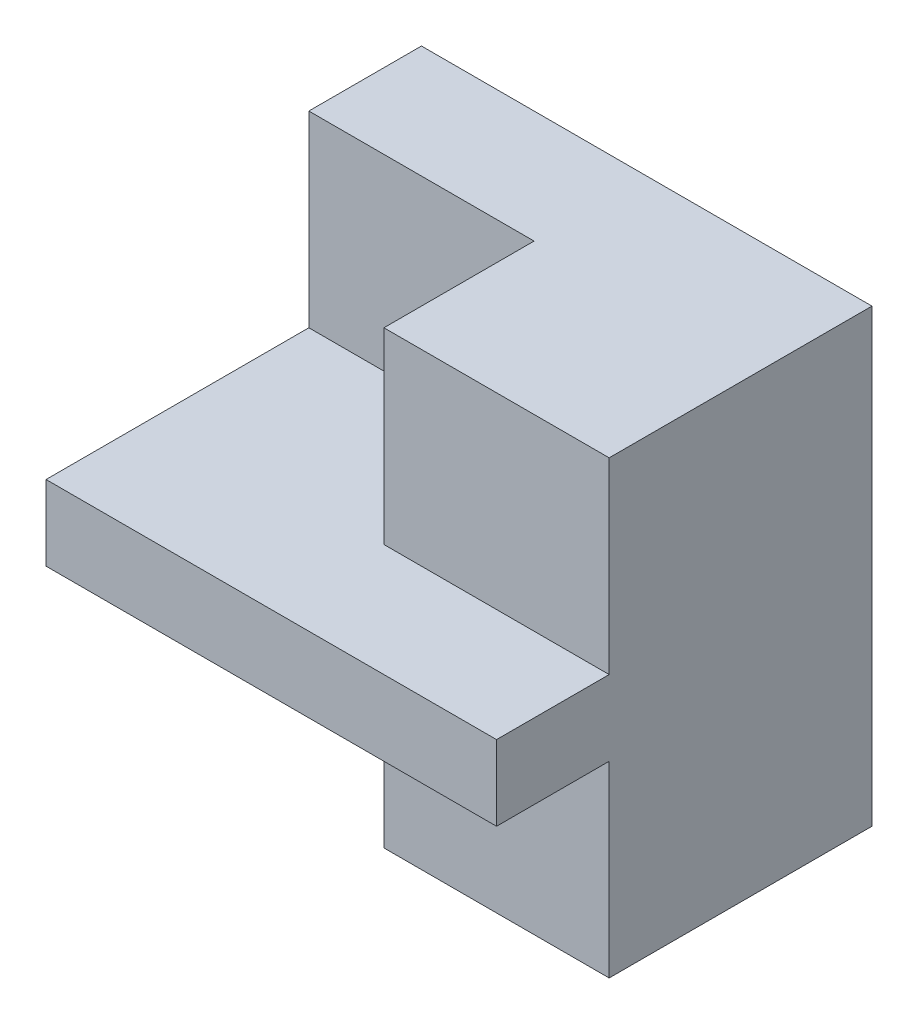
ISO-10303-21;
HEADER;
FILE_DESCRIPTION(('STEP AP214'),'2;1');
FILE_NAME('part.step','',(''),(''),'','','');
FILE_SCHEMA(('AUTOMOTIVE_DESIGN { 1 0 10303 214 1 1 1 1 }'));
ENDSEC;
DATA;
#1=APPLICATION_CONTEXT('core data for automotive mechanical design processes');
#2=APPLICATION_PROTOCOL_DEFINITION('international standard','automotive_design',2000,#1);
#3=PRODUCT_CONTEXT('',#1,'mechanical');
#4=PRODUCT('Part','Part','',(#3));
#5=PRODUCT_RELATED_PRODUCT_CATEGORY('part','',(#4));
#6=PRODUCT_DEFINITION_FORMATION('','',#4);
#7=PRODUCT_DEFINITION_CONTEXT('part definition',#1,'design');
#8=PRODUCT_DEFINITION('design','',#6,#7);
#9=PRODUCT_DEFINITION_SHAPE('','',#8);
#10=(LENGTH_UNIT() NAMED_UNIT(*) SI_UNIT(.MILLI.,.METRE.));
#11=(NAMED_UNIT(*) PLANE_ANGLE_UNIT() SI_UNIT($,.RADIAN.));
#12=(NAMED_UNIT(*) SI_UNIT($,.STERADIAN.) SOLID_ANGLE_UNIT());
#13=UNCERTAINTY_MEASURE_WITH_UNIT(LENGTH_MEASURE(1.E-05),#10,'distance_accuracy_value','');
#14=(GEOMETRIC_REPRESENTATION_CONTEXT(3) GLOBAL_UNCERTAINTY_ASSIGNED_CONTEXT((#13)) GLOBAL_UNIT_ASSIGNED_CONTEXT((#10,
#11,#12)) REPRESENTATION_CONTEXT('',''));
#15=CARTESIAN_POINT('',(0.,0.,0.));
#16=DIRECTION('',(0.,0.,1.));
#17=DIRECTION('',(1.,0.,0.));
#18=AXIS2_PLACEMENT_3D('',#15,#16,#17);
#19=CARTESIAN_POINT('',(-3.,6.,2.5));
#20=DIRECTION('',(0.,0.,-1.));
#21=DIRECTION('',(-1.,0.,0.));
#22=AXIS2_PLACEMENT_3D('',#19,#20,#21);
#23=PLANE('',#22);
#24=DIRECTION('',(0.,-1.,0.));
#25=VECTOR('',#24,1.);
#26=CARTESIAN_POINT('',(-3.,6.,2.5));
#27=LINE('',#26,#25);
#28=CARTESIAN_POINT('',(-3.,3.5,2.5));
#29=VERTEX_POINT('',#28);
#30=CARTESIAN_POINT('',(-3.,2.5,2.5));
#31=VERTEX_POINT('',#30);
#32=EDGE_CURVE('E144',#29,#31,#27,.T.);
#33=ORIENTED_EDGE('',*,*,#32,.T.);
#34=DIRECTION('',(-1.,0.,0.));
#35=VECTOR('',#34,1.);
#36=CARTESIAN_POINT('',(-3.,2.5,2.5));
#37=LINE('',#36,#35);
#38=CARTESIAN_POINT('',(3.,2.5,2.5));
#39=VERTEX_POINT('',#38);
#40=EDGE_CURVE('E128',#39,#31,#37,.T.);
#41=ORIENTED_EDGE('',*,*,#40,.F.);
#42=DIRECTION('',(0.,-1.,0.));
#43=VECTOR('',#42,1.);
#44=CARTESIAN_POINT('',(3.,6.,2.5));
#45=LINE('',#44,#43);
#46=CARTESIAN_POINT('',(3.,3.5,2.5));
#47=VERTEX_POINT('',#46);
#48=EDGE_CURVE('E142',#47,#39,#45,.T.);
#49=ORIENTED_EDGE('',*,*,#48,.F.);
#50=DIRECTION('',(1.,0.,0.));
#51=VECTOR('',#50,1.);
#52=CARTESIAN_POINT('',(-3.,3.5,2.5));
#53=LINE('',#52,#51);
#54=EDGE_CURVE('E186',#29,#47,#53,.T.);
#55=ORIENTED_EDGE('',*,*,#54,.F.);
#56=EDGE_LOOP('',(#33,#41,#49,#55));
#57=FACE_BOUND('',#56,.T.);
#58=ADVANCED_FACE('F33',(#57),#23,.F.);
#59=CARTESIAN_POINT('',(3.,6.,2.5));
#60=DIRECTION('',(-1.,0.,0.));
#61=DIRECTION('',(0.,0.,1.));
#62=AXIS2_PLACEMENT_3D('',#59,#60,#61);
#63=PLANE('',#62);
#64=DIRECTION('',(0.,0.,1.));
#65=VECTOR('',#64,1.);
#66=CARTESIAN_POINT('',(3.,2.5,2.5));
#67=LINE('',#66,#65);
#68=CARTESIAN_POINT('',(3.,2.5,1.));
#69=VERTEX_POINT('',#68);
#70=EDGE_CURVE('E124',#69,#39,#67,.T.);
#71=ORIENTED_EDGE('',*,*,#70,.F.);
#72=DIRECTION('',(0.,-1.,0.));
#73=VECTOR('',#72,1.);
#74=CARTESIAN_POINT('',(3.,2.5,1.));
#75=LINE('',#74,#73);
#76=CARTESIAN_POINT('',(3.,0.,1.));
#77=VERTEX_POINT('',#76);
#78=EDGE_CURVE('E198',#69,#77,#75,.T.);
#79=ORIENTED_EDGE('',*,*,#78,.T.);
#80=DIRECTION('',(0.,0.,-1.));
#81=VECTOR('',#80,1.);
#82=CARTESIAN_POINT('',(3.,0.,2.5));
#83=LINE('',#82,#81);
#84=CARTESIAN_POINT('',(3.,0.,-2.5));
#85=VERTEX_POINT('',#84);
#86=EDGE_CURVE('E179',#77,#85,#83,.T.);
#87=ORIENTED_EDGE('',*,*,#86,.T.);
#88=DIRECTION('',(0.,-1.,0.));
#89=VECTOR('',#88,1.);
#90=CARTESIAN_POINT('',(3.,6.,-2.5));
#91=LINE('',#90,#89);
#92=CARTESIAN_POINT('',(3.,6.,-2.5));
#93=VERTEX_POINT('',#92);
#94=EDGE_CURVE('E11',#93,#85,#91,.T.);
#95=ORIENTED_EDGE('',*,*,#94,.F.);
#96=DIRECTION('',(0.,0.,-1.));
#97=VECTOR('',#96,1.);
#98=CARTESIAN_POINT('',(3.,6.,2.5));
#99=LINE('',#98,#97);
#100=CARTESIAN_POINT('',(3.,6.,1.));
#101=VERTEX_POINT('',#100);
#102=EDGE_CURVE('E177',#101,#93,#99,.T.);
#103=ORIENTED_EDGE('',*,*,#102,.F.);
#104=DIRECTION('',(0.,1.,0.));
#105=VECTOR('',#104,1.);
#106=CARTESIAN_POINT('',(3.,3.5,1.));
#107=LINE('',#106,#105);
#108=CARTESIAN_POINT('',(3.,3.5,1.));
#109=VERTEX_POINT('',#108);
#110=EDGE_CURVE('E56',#109,#101,#107,.T.);
#111=ORIENTED_EDGE('',*,*,#110,.F.);
#112=DIRECTION('',(0.,0.,-1.));
#113=VECTOR('',#112,1.);
#114=CARTESIAN_POINT('',(3.,3.5,2.5));
#115=LINE('',#114,#113);
#116=EDGE_CURVE('E149',#47,#109,#115,.T.);
#117=ORIENTED_EDGE('',*,*,#116,.F.);
#118=ORIENTED_EDGE('',*,*,#48,.T.);
#119=EDGE_LOOP('',(#71,#79,#87,#95,#103,#111,#117,#118));
#120=FACE_BOUND('',#119,.T.);
#121=ADVANCED_FACE('F35',(#120),#63,.F.);
#122=CARTESIAN_POINT('',(-3.,6.,-2.5));
#123=DIRECTION('',(0.,0.,1.));
#124=DIRECTION('',(1.,0.,0.));
#125=AXIS2_PLACEMENT_3D('',#122,#123,#124);
#126=PLANE('',#125);
#127=DIRECTION('',(-1.,0.,0.));
#128=VECTOR('',#127,1.);
#129=CARTESIAN_POINT('',(-3.,0.,-2.5));
#130=LINE('',#129,#128);
#131=CARTESIAN_POINT('',(-3.,0.,-2.5));
#132=VERTEX_POINT('',#131);
#133=EDGE_CURVE('E174',#85,#132,#130,.T.);
#134=ORIENTED_EDGE('',*,*,#133,.T.);
#135=DIRECTION('',(0.,-1.,0.));
#136=VECTOR('',#135,1.);
#137=CARTESIAN_POINT('',(-3.,6.,-2.5));
#138=LINE('',#137,#136);
#139=CARTESIAN_POINT('',(-3.,6.,-2.5));
#140=VERTEX_POINT('',#139);
#141=EDGE_CURVE('E41',#140,#132,#138,.T.);
#142=ORIENTED_EDGE('',*,*,#141,.F.);
#143=DIRECTION('',(-1.,0.,0.));
#144=VECTOR('',#143,1.);
#145=CARTESIAN_POINT('',(-3.,6.,-2.5));
#146=LINE('',#145,#144);
#147=EDGE_CURVE('E154',#93,#140,#146,.T.);
#148=ORIENTED_EDGE('',*,*,#147,.F.);
#149=ORIENTED_EDGE('',*,*,#94,.T.);
#150=EDGE_LOOP('',(#134,#142,#148,#149));
#151=FACE_BOUND('',#150,.T.);
#152=ADVANCED_FACE('F242',(#151),#126,.F.);
#153=CARTESIAN_POINT('',(-3.,6.,2.5));
#154=DIRECTION('',(1.,0.,0.));
#155=DIRECTION('',(0.,0.,-1.));
#156=AXIS2_PLACEMENT_3D('',#153,#154,#155);
#157=PLANE('',#156);
#158=DIRECTION('',(0.,0.,1.));
#159=VECTOR('',#158,1.);
#160=CARTESIAN_POINT('',(-3.,0.,2.5));
#161=LINE('',#160,#159);
#162=CARTESIAN_POINT('',(-3.,0.,-1.));
#163=VERTEX_POINT('',#162);
#164=EDGE_CURVE('E157',#132,#163,#161,.T.);
#165=ORIENTED_EDGE('',*,*,#164,.T.);
#166=DIRECTION('',(0.,-1.,0.));
#167=VECTOR('',#166,1.);
#168=CARTESIAN_POINT('',(-3.,2.5,-1.));
#169=LINE('',#168,#167);
#170=CARTESIAN_POINT('',(-3.,2.5,-1.));
#171=VERTEX_POINT('',#170);
#172=EDGE_CURVE('E48',#171,#163,#169,.T.);
#173=ORIENTED_EDGE('',*,*,#172,.F.);
#174=DIRECTION('',(0.,0.,-1.));
#175=VECTOR('',#174,1.);
#176=CARTESIAN_POINT('',(-3.,2.5,-1.));
#177=LINE('',#176,#175);
#178=EDGE_CURVE('E145',#31,#171,#177,.T.);
#179=ORIENTED_EDGE('',*,*,#178,.F.);
#180=ORIENTED_EDGE('',*,*,#32,.F.);
#181=DIRECTION('',(0.,0.,1.));
#182=VECTOR('',#181,1.);
#183=CARTESIAN_POINT('',(-3.,3.5,-1.));
#184=LINE('',#183,#182);
#185=CARTESIAN_POINT('',(-3.,3.5,-1.));
#186=VERTEX_POINT('',#185);
#187=EDGE_CURVE('E200',#186,#29,#184,.T.);
#188=ORIENTED_EDGE('',*,*,#187,.F.);
#189=DIRECTION('',(0.,1.,0.));
#190=VECTOR('',#189,1.);
#191=CARTESIAN_POINT('',(-3.,3.5,-1.));
#192=LINE('',#191,#190);
#193=CARTESIAN_POINT('',(-3.,6.,-1.));
#194=VERTEX_POINT('',#193);
#195=EDGE_CURVE('E180',#186,#194,#192,.T.);
#196=ORIENTED_EDGE('',*,*,#195,.T.);
#197=DIRECTION('',(0.,0.,1.));
#198=VECTOR('',#197,1.);
#199=CARTESIAN_POINT('',(-3.,6.,2.5));
#200=LINE('',#199,#198);
#201=EDGE_CURVE('E150',#140,#194,#200,.T.);
#202=ORIENTED_EDGE('',*,*,#201,.F.);
#203=ORIENTED_EDGE('',*,*,#141,.T.);
#204=EDGE_LOOP('',(#165,#173,#179,#180,#188,#196,#202,#203));
#205=FACE_BOUND('',#204,.T.);
#206=ADVANCED_FACE('F165',(#205),#157,.F.);
#207=CARTESIAN_POINT('',(0.,6.,0.));
#208=DIRECTION('',(0.,-1.,0.));
#209=DIRECTION('',(0.,0.,-1.));
#210=AXIS2_PLACEMENT_3D('',#207,#208,#209);
#211=PLANE('',#210);
#212=ORIENTED_EDGE('',*,*,#201,.T.);
#213=DIRECTION('',(-1.,0.,0.));
#214=VECTOR('',#213,1.);
#215=CARTESIAN_POINT('',(0.,6.,-1.));
#216=LINE('',#215,#214);
#217=CARTESIAN_POINT('',(0.,6.,-1.));
#218=VERTEX_POINT('',#217);
#219=EDGE_CURVE('E191',#218,#194,#216,.T.);
#220=ORIENTED_EDGE('',*,*,#219,.F.);
#221=DIRECTION('',(0.,0.,-1.));
#222=VECTOR('',#221,1.);
#223=CARTESIAN_POINT('',(0.,6.,1.));
#224=LINE('',#223,#222);
#225=CARTESIAN_POINT('',(0.,6.,1.));
#226=VERTEX_POINT('',#225);
#227=EDGE_CURVE('E193',#226,#218,#224,.T.);
#228=ORIENTED_EDGE('',*,*,#227,.F.);
#229=DIRECTION('',(-1.,0.,0.));
#230=VECTOR('',#229,1.);
#231=CARTESIAN_POINT('',(3.,6.,1.));
#232=LINE('',#231,#230);
#233=EDGE_CURVE('E196',#101,#226,#232,.T.);
#234=ORIENTED_EDGE('',*,*,#233,.F.);
#235=ORIENTED_EDGE('',*,*,#102,.T.);
#236=ORIENTED_EDGE('',*,*,#147,.T.);
#237=EDGE_LOOP('',(#212,#220,#228,#234,#235,#236));
#238=FACE_BOUND('',#237,.T.);
#239=ADVANCED_FACE('F239',(#238),#211,.F.);
#240=CARTESIAN_POINT('',(0.,0.,0.));
#241=DIRECTION('',(0.,-1.,0.));
#242=DIRECTION('',(0.,0.,-1.));
#243=AXIS2_PLACEMENT_3D('',#240,#241,#242);
#244=PLANE('',#243);
#245=DIRECTION('',(1.,0.,0.));
#246=VECTOR('',#245,1.);
#247=CARTESIAN_POINT('',(3.,0.,1.));
#248=LINE('',#247,#246);
#249=CARTESIAN_POINT('',(0.,0.,1.));
#250=VERTEX_POINT('',#249);
#251=EDGE_CURVE('E136',#250,#77,#248,.T.);
#252=ORIENTED_EDGE('',*,*,#251,.F.);
#253=DIRECTION('',(0.,0.,1.));
#254=VECTOR('',#253,1.);
#255=CARTESIAN_POINT('',(0.,0.,1.));
#256=LINE('',#255,#254);
#257=CARTESIAN_POINT('',(0.,0.,-1.));
#258=VERTEX_POINT('',#257);
#259=EDGE_CURVE('E219',#258,#250,#256,.T.);
#260=ORIENTED_EDGE('',*,*,#259,.F.);
#261=DIRECTION('',(1.,0.,0.));
#262=VECTOR('',#261,1.);
#263=CARTESIAN_POINT('',(0.,0.,-1.));
#264=LINE('',#263,#262);
#265=EDGE_CURVE('E176',#163,#258,#264,.T.);
#266=ORIENTED_EDGE('',*,*,#265,.F.);
#267=ORIENTED_EDGE('',*,*,#164,.F.);
#268=ORIENTED_EDGE('',*,*,#133,.F.);
#269=ORIENTED_EDGE('',*,*,#86,.F.);
#270=EDGE_LOOP('',(#252,#260,#266,#267,#268,#269));
#271=FACE_BOUND('',#270,.T.);
#272=ADVANCED_FACE('F172',(#271),#244,.T.);
#273=CARTESIAN_POINT('',(0.,3.5,-1.));
#274=DIRECTION('',(0.,0.,-1.));
#275=DIRECTION('',(-1.,0.,0.));
#276=AXIS2_PLACEMENT_3D('',#273,#274,#275);
#277=PLANE('',#276);
#278=ORIENTED_EDGE('',*,*,#219,.T.);
#279=ORIENTED_EDGE('',*,*,#195,.F.);
#280=DIRECTION('',(-1.,0.,0.));
#281=VECTOR('',#280,1.);
#282=CARTESIAN_POINT('',(0.,3.5,-1.));
#283=LINE('',#282,#281);
#284=CARTESIAN_POINT('',(0.,3.5,-1.));
#285=VERTEX_POINT('',#284);
#286=EDGE_CURVE('E202',#285,#186,#283,.T.);
#287=ORIENTED_EDGE('',*,*,#286,.F.);
#288=DIRECTION('',(0.,1.,0.));
#289=VECTOR('',#288,1.);
#290=CARTESIAN_POINT('',(0.,3.5,-1.));
#291=LINE('',#290,#289);
#292=EDGE_CURVE('E188',#285,#218,#291,.T.);
#293=ORIENTED_EDGE('',*,*,#292,.T.);
#294=EDGE_LOOP('',(#278,#279,#287,#293));
#295=FACE_BOUND('',#294,.T.);
#296=ADVANCED_FACE('F235',(#295),#277,.F.);
#297=CARTESIAN_POINT('',(0.,3.5,1.));
#298=DIRECTION('',(1.,0.,0.));
#299=DIRECTION('',(0.,0.,-1.));
#300=AXIS2_PLACEMENT_3D('',#297,#298,#299);
#301=PLANE('',#300);
#302=ORIENTED_EDGE('',*,*,#227,.T.);
#303=ORIENTED_EDGE('',*,*,#292,.F.);
#304=DIRECTION('',(0.,0.,-1.));
#305=VECTOR('',#304,1.);
#306=CARTESIAN_POINT('',(0.,3.5,1.));
#307=LINE('',#306,#305);
#308=CARTESIAN_POINT('',(0.,3.5,1.));
#309=VERTEX_POINT('',#308);
#310=EDGE_CURVE('E205',#309,#285,#307,.T.);
#311=ORIENTED_EDGE('',*,*,#310,.F.);
#312=DIRECTION('',(0.,1.,0.));
#313=VECTOR('',#312,1.);
#314=CARTESIAN_POINT('',(0.,3.5,1.));
#315=LINE('',#314,#313);
#316=EDGE_CURVE('E185',#309,#226,#315,.T.);
#317=ORIENTED_EDGE('',*,*,#316,.T.);
#318=EDGE_LOOP('',(#302,#303,#311,#317));
#319=FACE_BOUND('',#318,.T.);
#320=ADVANCED_FACE('F293',(#319),#301,.F.);
#321=CARTESIAN_POINT('',(3.,3.5,1.));
#322=DIRECTION('',(0.,0.,-1.));
#323=DIRECTION('',(-1.,0.,0.));
#324=AXIS2_PLACEMENT_3D('',#321,#322,#323);
#325=PLANE('',#324);
#326=ORIENTED_EDGE('',*,*,#233,.T.);
#327=ORIENTED_EDGE('',*,*,#316,.F.);
#328=DIRECTION('',(-1.,0.,0.));
#329=VECTOR('',#328,1.);
#330=CARTESIAN_POINT('',(3.,3.5,1.));
#331=LINE('',#330,#329);
#332=EDGE_CURVE('E208',#109,#309,#331,.T.);
#333=ORIENTED_EDGE('',*,*,#332,.F.);
#334=ORIENTED_EDGE('',*,*,#110,.T.);
#335=EDGE_LOOP('',(#326,#327,#333,#334));
#336=FACE_BOUND('',#335,.T.);
#337=ADVANCED_FACE('F300',(#336),#325,.F.);
#338=CARTESIAN_POINT('',(0.,3.5,0.));
#339=DIRECTION('',(0.,1.,0.));
#340=DIRECTION('',(0.,0.,1.));
#341=AXIS2_PLACEMENT_3D('',#338,#339,#340);
#342=PLANE('',#341);
#343=ORIENTED_EDGE('',*,*,#116,.T.);
#344=ORIENTED_EDGE('',*,*,#332,.T.);
#345=ORIENTED_EDGE('',*,*,#310,.T.);
#346=ORIENTED_EDGE('',*,*,#286,.T.);
#347=ORIENTED_EDGE('',*,*,#187,.T.);
#348=ORIENTED_EDGE('',*,*,#54,.T.);
#349=EDGE_LOOP('',(#343,#344,#345,#346,#347,#348));
#350=FACE_BOUND('',#349,.T.);
#351=ADVANCED_FACE('F231',(#350),#342,.T.);
#352=CARTESIAN_POINT('',(3.,2.5,1.));
#353=DIRECTION('',(0.,0.,-1.));
#354=DIRECTION('',(-1.,0.,0.));
#355=AXIS2_PLACEMENT_3D('',#352,#353,#354);
#356=PLANE('',#355);
#357=ORIENTED_EDGE('',*,*,#251,.T.);
#358=ORIENTED_EDGE('',*,*,#78,.F.);
#359=DIRECTION('',(1.,0.,0.));
#360=VECTOR('',#359,1.);
#361=CARTESIAN_POINT('',(3.,2.5,1.));
#362=LINE('',#361,#360);
#363=CARTESIAN_POINT('',(0.,2.5,1.));
#364=VERTEX_POINT('',#363);
#365=EDGE_CURVE('E132',#364,#69,#362,.T.);
#366=ORIENTED_EDGE('',*,*,#365,.F.);
#367=DIRECTION('',(0.,-1.,0.));
#368=VECTOR('',#367,1.);
#369=CARTESIAN_POINT('',(0.,2.5,1.));
#370=LINE('',#369,#368);
#371=EDGE_CURVE('E215',#364,#250,#370,.T.);
#372=ORIENTED_EDGE('',*,*,#371,.T.);
#373=EDGE_LOOP('',(#357,#358,#366,#372));
#374=FACE_BOUND('',#373,.T.);
#375=ADVANCED_FACE('F244',(#374),#356,.F.);
#376=CARTESIAN_POINT('',(0.,2.5,1.));
#377=DIRECTION('',(1.,0.,0.));
#378=DIRECTION('',(0.,0.,-1.));
#379=AXIS2_PLACEMENT_3D('',#376,#377,#378);
#380=PLANE('',#379);
#381=ORIENTED_EDGE('',*,*,#259,.T.);
#382=ORIENTED_EDGE('',*,*,#371,.F.);
#383=DIRECTION('',(0.,0.,1.));
#384=VECTOR('',#383,1.);
#385=CARTESIAN_POINT('',(0.,2.5,1.));
#386=LINE('',#385,#384);
#387=CARTESIAN_POINT('',(0.,2.5,-1.));
#388=VERTEX_POINT('',#387);
#389=EDGE_CURVE('E224',#388,#364,#386,.T.);
#390=ORIENTED_EDGE('',*,*,#389,.F.);
#391=DIRECTION('',(0.,-1.,0.));
#392=VECTOR('',#391,1.);
#393=CARTESIAN_POINT('',(0.,2.5,-1.));
#394=LINE('',#393,#392);
#395=EDGE_CURVE('E213',#388,#258,#394,.T.);
#396=ORIENTED_EDGE('',*,*,#395,.T.);
#397=EDGE_LOOP('',(#381,#382,#390,#396));
#398=FACE_BOUND('',#397,.T.);
#399=ADVANCED_FACE('F247',(#398),#380,.F.);
#400=CARTESIAN_POINT('',(0.,2.5,-1.));
#401=DIRECTION('',(0.,0.,-1.));
#402=DIRECTION('',(-1.,0.,0.));
#403=AXIS2_PLACEMENT_3D('',#400,#401,#402);
#404=PLANE('',#403);
#405=ORIENTED_EDGE('',*,*,#265,.T.);
#406=ORIENTED_EDGE('',*,*,#395,.F.);
#407=DIRECTION('',(1.,0.,0.));
#408=VECTOR('',#407,1.);
#409=CARTESIAN_POINT('',(0.,2.5,-1.));
#410=LINE('',#409,#408);
#411=EDGE_CURVE('E226',#171,#388,#410,.T.);
#412=ORIENTED_EDGE('',*,*,#411,.F.);
#413=ORIENTED_EDGE('',*,*,#172,.T.);
#414=EDGE_LOOP('',(#405,#406,#412,#413));
#415=FACE_BOUND('',#414,.T.);
#416=ADVANCED_FACE('F248',(#415),#404,.F.);
#417=CARTESIAN_POINT('',(0.,2.5,0.));
#418=DIRECTION('',(0.,1.,0.));
#419=DIRECTION('',(0.,0.,1.));
#420=AXIS2_PLACEMENT_3D('',#417,#418,#419);
#421=PLANE('',#420);
#422=ORIENTED_EDGE('',*,*,#70,.T.);
#423=ORIENTED_EDGE('',*,*,#40,.T.);
#424=ORIENTED_EDGE('',*,*,#178,.T.);
#425=ORIENTED_EDGE('',*,*,#411,.T.);
#426=ORIENTED_EDGE('',*,*,#389,.T.);
#427=ORIENTED_EDGE('',*,*,#365,.T.);
#428=EDGE_LOOP('',(#422,#423,#424,#425,#426,#427));
#429=FACE_BOUND('',#428,.T.);
#430=ADVANCED_FACE('F126',(#429),#421,.F.);
#431=CLOSED_SHELL('',(#58,#121,#152,#206,#239,#272,#296,#320,#337,#351,#375,#399,#416,#430));
#432=MANIFOLD_SOLID_BREP('B2',#431);
#433=ADVANCED_BREP_SHAPE_REPRESENTATION('',(#18,#432),#14);
#434=SHAPE_DEFINITION_REPRESENTATION(#9,#433);
ENDSEC;
END-ISO-10303-21;
